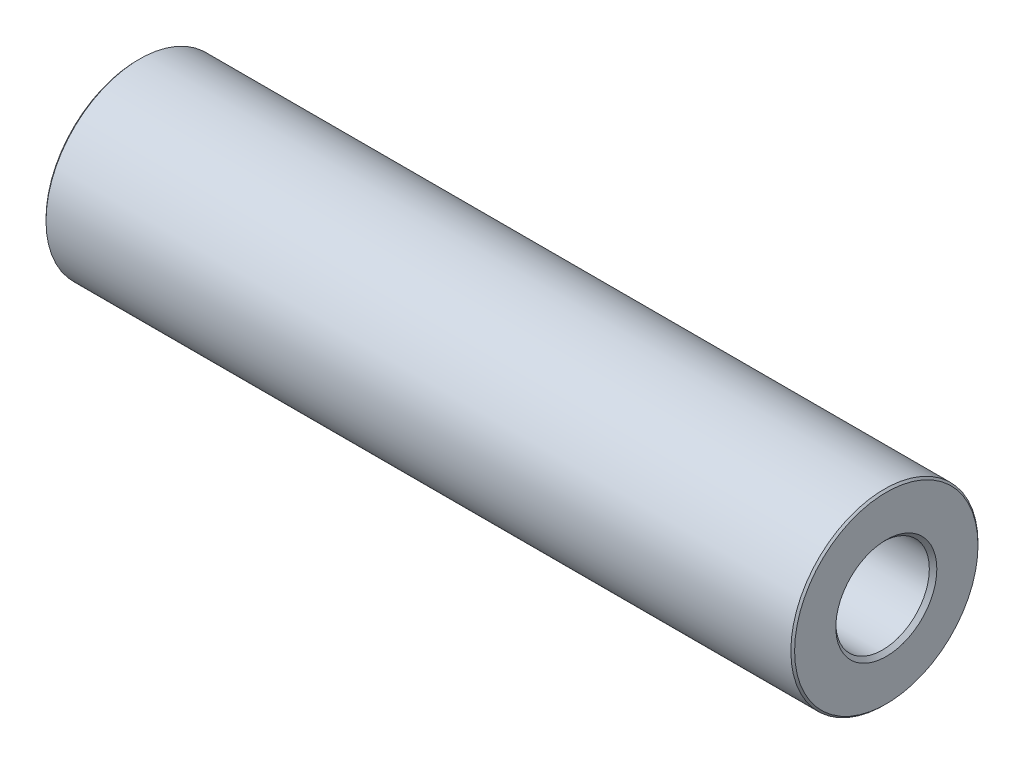
ISO-10303-21;
HEADER;
FILE_DESCRIPTION(('STEP AP214'),'2;1');
FILE_NAME('part.step','',(''),(''),'','','');
FILE_SCHEMA(('AUTOMOTIVE_DESIGN { 1 0 10303 214 1 1 1 1 }'));
ENDSEC;
DATA;
#1=APPLICATION_CONTEXT('core data for automotive mechanical design processes');
#2=APPLICATION_PROTOCOL_DEFINITION('international standard','automotive_design',2000,#1);
#3=PRODUCT_CONTEXT('',#1,'mechanical');
#4=PRODUCT('Part','Part','',(#3));
#5=PRODUCT_RELATED_PRODUCT_CATEGORY('part','',(#4));
#6=PRODUCT_DEFINITION_FORMATION('','',#4);
#7=PRODUCT_DEFINITION_CONTEXT('part definition',#1,'design');
#8=PRODUCT_DEFINITION('design','',#6,#7);
#9=PRODUCT_DEFINITION_SHAPE('','',#8);
#10=(LENGTH_UNIT() NAMED_UNIT(*) SI_UNIT(.MILLI.,.METRE.));
#11=(NAMED_UNIT(*) PLANE_ANGLE_UNIT() SI_UNIT($,.RADIAN.));
#12=(NAMED_UNIT(*) SI_UNIT($,.STERADIAN.) SOLID_ANGLE_UNIT());
#13=UNCERTAINTY_MEASURE_WITH_UNIT(LENGTH_MEASURE(1.E-05),#10,'distance_accuracy_value','');
#14=(GEOMETRIC_REPRESENTATION_CONTEXT(3) GLOBAL_UNCERTAINTY_ASSIGNED_CONTEXT((#13)) GLOBAL_UNIT_ASSIGNED_CONTEXT((#10,
#11,#12)) REPRESENTATION_CONTEXT('',''));
#15=CARTESIAN_POINT('',(0.,0.,0.));
#16=DIRECTION('',(0.,0.,1.));
#17=DIRECTION('',(1.,0.,0.));
#18=AXIS2_PLACEMENT_3D('',#15,#16,#17);
#19=CARTESIAN_POINT('',(40.,0.,0.));
#20=DIRECTION('',(1.,0.,0.));
#21=DIRECTION('',(0.,0.,-1.));
#22=AXIS2_PLACEMENT_3D('',#19,#20,#21);
#23=PLANE('',#22);
#24=CARTESIAN_POINT('',(40.,0.,0.));
#25=DIRECTION('',(1.,0.,0.));
#26=DIRECTION('',(0.,0.,-1.));
#27=AXIS2_PLACEMENT_3D('',#24,#25,#26);
#28=CIRCLE('',#27,4.9);
#29=CARTESIAN_POINT('',(40.,0.,-4.9));
#30=VERTEX_POINT('',#29);
#31=EDGE_CURVE('E8',#30,#30,#28,.T.);
#32=ORIENTED_EDGE('',*,*,#31,.T.);
#33=EDGE_LOOP('',(#32));
#34=FACE_BOUND('',#33,.T.);
#35=CARTESIAN_POINT('',(40.,0.,0.));
#36=DIRECTION('',(1.,0.,0.));
#37=DIRECTION('',(0.,0.,-1.));
#38=AXIS2_PLACEMENT_3D('',#35,#36,#37);
#39=CIRCLE('',#38,2.69999999999999);
#40=CARTESIAN_POINT('',(40.,0.,-2.69999999999999));
#41=VERTEX_POINT('',#40);
#42=EDGE_CURVE('E39',#41,#41,#39,.F.);
#43=ORIENTED_EDGE('',*,*,#42,.T.);
#44=EDGE_LOOP('',(#43));
#45=FACE_BOUND('',#44,.T.);
#46=ADVANCED_FACE('F13',(#34,#45),#23,.T.);
#47=CARTESIAN_POINT('',(0.,0.,0.));
#48=DIRECTION('',(1.,0.,0.));
#49=DIRECTION('',(0.,0.,-1.));
#50=AXIS2_PLACEMENT_3D('',#47,#48,#49);
#51=PLANE('',#50);
#52=CARTESIAN_POINT('',(0.,0.,0.));
#53=DIRECTION('',(1.,0.,0.));
#54=DIRECTION('',(0.,0.,-1.));
#55=AXIS2_PLACEMENT_3D('',#52,#53,#54);
#56=CIRCLE('',#55,2.6);
#57=CARTESIAN_POINT('',(0.,0.,-2.6));
#58=VERTEX_POINT('',#57);
#59=EDGE_CURVE('E33',#58,#58,#56,.T.);
#60=ORIENTED_EDGE('',*,*,#59,.T.);
#61=EDGE_LOOP('',(#60));
#62=FACE_BOUND('',#61,.T.);
#63=CARTESIAN_POINT('',(0.,0.,0.));
#64=DIRECTION('',(1.,0.,0.));
#65=DIRECTION('',(0.,0.,-1.));
#66=AXIS2_PLACEMENT_3D('',#63,#64,#65);
#67=CIRCLE('',#66,4.9);
#68=CARTESIAN_POINT('',(0.,0.,-4.9));
#69=VERTEX_POINT('',#68);
#70=EDGE_CURVE('E36',#69,#69,#67,.F.);
#71=ORIENTED_EDGE('',*,*,#70,.T.);
#72=EDGE_LOOP('',(#71));
#73=FACE_BOUND('',#72,.T.);
#74=ADVANCED_FACE('F67',(#62,#73),#51,.F.);
#75=CARTESIAN_POINT('',(40.,0.,0.));
#76=DIRECTION('',(-1.,0.,0.));
#77=DIRECTION('',(0.,0.,1.));
#78=AXIS2_PLACEMENT_3D('',#75,#76,#77);
#79=CYLINDRICAL_SURFACE('',#78,5.);
#80=CARTESIAN_POINT('',(0.0999999999999959,0.,0.));
#81=DIRECTION('',(1.,0.,0.));
#82=DIRECTION('',(0.,0.,-1.));
#83=AXIS2_PLACEMENT_3D('',#80,#81,#82);
#84=CIRCLE('',#83,5.);
#85=CARTESIAN_POINT('',(0.0999999999999959,0.,-5.));
#86=VERTEX_POINT('',#85);
#87=EDGE_CURVE('E20',#86,#86,#84,.T.);
#88=ORIENTED_EDGE('',*,*,#87,.T.);
#89=EDGE_LOOP('',(#88));
#90=FACE_BOUND('',#89,.T.);
#91=CARTESIAN_POINT('',(39.9,0.,0.));
#92=DIRECTION('',(1.,0.,0.));
#93=DIRECTION('',(0.,0.,-1.));
#94=AXIS2_PLACEMENT_3D('',#91,#92,#93);
#95=CIRCLE('',#94,5.);
#96=CARTESIAN_POINT('',(39.9,0.,-5.));
#97=VERTEX_POINT('',#96);
#98=EDGE_CURVE('E24',#97,#97,#95,.F.);
#99=ORIENTED_EDGE('',*,*,#98,.T.);
#100=EDGE_LOOP('',(#99));
#101=FACE_BOUND('',#100,.T.);
#102=ADVANCED_FACE('F61',(#90,#101),#79,.T.);
#103=CARTESIAN_POINT('',(40.,0.,0.));
#104=DIRECTION('',(-1.,0.,0.));
#105=DIRECTION('',(0.,0.,1.));
#106=AXIS2_PLACEMENT_3D('',#103,#104,#105);
#107=CYLINDRICAL_SURFACE('',#106,2.5);
#108=CARTESIAN_POINT('',(0.100000000000003,0.,0.));
#109=DIRECTION('',(1.,0.,0.));
#110=DIRECTION('',(0.,0.,-1.));
#111=AXIS2_PLACEMENT_3D('',#108,#109,#110);
#112=CIRCLE('',#111,2.5);
#113=CARTESIAN_POINT('',(0.100000000000003,0.,-2.5));
#114=VERTEX_POINT('',#113);
#115=EDGE_CURVE('E28',#114,#114,#112,.F.);
#116=ORIENTED_EDGE('',*,*,#115,.T.);
#117=EDGE_LOOP('',(#116));
#118=FACE_BOUND('',#117,.T.);
#119=CARTESIAN_POINT('',(39.8,0.,0.));
#120=DIRECTION('',(1.,0.,0.));
#121=DIRECTION('',(0.,0.,-1.));
#122=AXIS2_PLACEMENT_3D('',#119,#120,#121);
#123=CIRCLE('',#122,2.5);
#124=CARTESIAN_POINT('',(39.8,0.,-2.5));
#125=VERTEX_POINT('',#124);
#126=EDGE_CURVE('E42',#125,#125,#123,.T.);
#127=ORIENTED_EDGE('',*,*,#126,.T.);
#128=EDGE_LOOP('',(#127));
#129=FACE_BOUND('',#128,.T.);
#130=ADVANCED_FACE('F46',(#118,#129),#107,.F.);
#131=CARTESIAN_POINT('',(39.8,0.,0.));
#132=DIRECTION('',(1.,0.,0.));
#133=DIRECTION('',(0.,0.,-1.));
#134=AXIS2_PLACEMENT_3D('',#131,#132,#133);
#135=CONICAL_SURFACE('',#134,2.5,0.785398163397454);
#136=ORIENTED_EDGE('',*,*,#42,.F.);
#137=EDGE_LOOP('',(#136));
#138=FACE_BOUND('',#137,.T.);
#139=ORIENTED_EDGE('',*,*,#126,.F.);
#140=EDGE_LOOP('',(#139));
#141=FACE_BOUND('',#140,.T.);
#142=ADVANCED_FACE('F48',(#138,#141),#135,.F.);
#143=CARTESIAN_POINT('',(0.,0.,0.));
#144=DIRECTION('',(-1.,0.,0.));
#145=DIRECTION('',(0.,0.,1.));
#146=AXIS2_PLACEMENT_3D('',#143,#144,#145);
#147=CONICAL_SURFACE('',#146,2.6,0.785398163397442);
#148=ORIENTED_EDGE('',*,*,#115,.F.);
#149=EDGE_LOOP('',(#148));
#150=FACE_BOUND('',#149,.T.);
#151=ORIENTED_EDGE('',*,*,#59,.F.);
#152=EDGE_LOOP('',(#151));
#153=FACE_BOUND('',#152,.T.);
#154=ADVANCED_FACE('F50',(#150,#153),#147,.F.);
#155=CARTESIAN_POINT('',(0.0999999999999959,0.,0.));
#156=DIRECTION('',(1.,0.,0.));
#157=DIRECTION('',(0.,0.,-1.));
#158=AXIS2_PLACEMENT_3D('',#155,#156,#157);
#159=CONICAL_SURFACE('',#158,5.,0.785398163397457);
#160=ORIENTED_EDGE('',*,*,#70,.F.);
#161=EDGE_LOOP('',(#160));
#162=FACE_BOUND('',#161,.T.);
#163=ORIENTED_EDGE('',*,*,#87,.F.);
#164=EDGE_LOOP('',(#163));
#165=FACE_BOUND('',#164,.T.);
#166=ADVANCED_FACE('F58',(#162,#165),#159,.T.);
#167=CARTESIAN_POINT('',(40.,0.,0.));
#168=DIRECTION('',(-1.,0.,0.));
#169=DIRECTION('',(0.,0.,1.));
#170=AXIS2_PLACEMENT_3D('',#167,#168,#169);
#171=CONICAL_SURFACE('',#170,4.9,0.785398163397457);
#172=ORIENTED_EDGE('',*,*,#98,.F.);
#173=EDGE_LOOP('',(#172));
#174=FACE_BOUND('',#173,.T.);
#175=ORIENTED_EDGE('',*,*,#31,.F.);
#176=EDGE_LOOP('',(#175));
#177=FACE_BOUND('',#176,.T.);
#178=ADVANCED_FACE('F15',(#174,#177),#171,.T.);
#179=CLOSED_SHELL('',(#46,#74,#102,#130,#142,#154,#166,#178));
#180=MANIFOLD_SOLID_BREP('B1',#179);
#181=ADVANCED_BREP_SHAPE_REPRESENTATION('',(#18,#180),#14);
#182=SHAPE_DEFINITION_REPRESENTATION(#9,#181);
ENDSEC;
END-ISO-10303-21;
